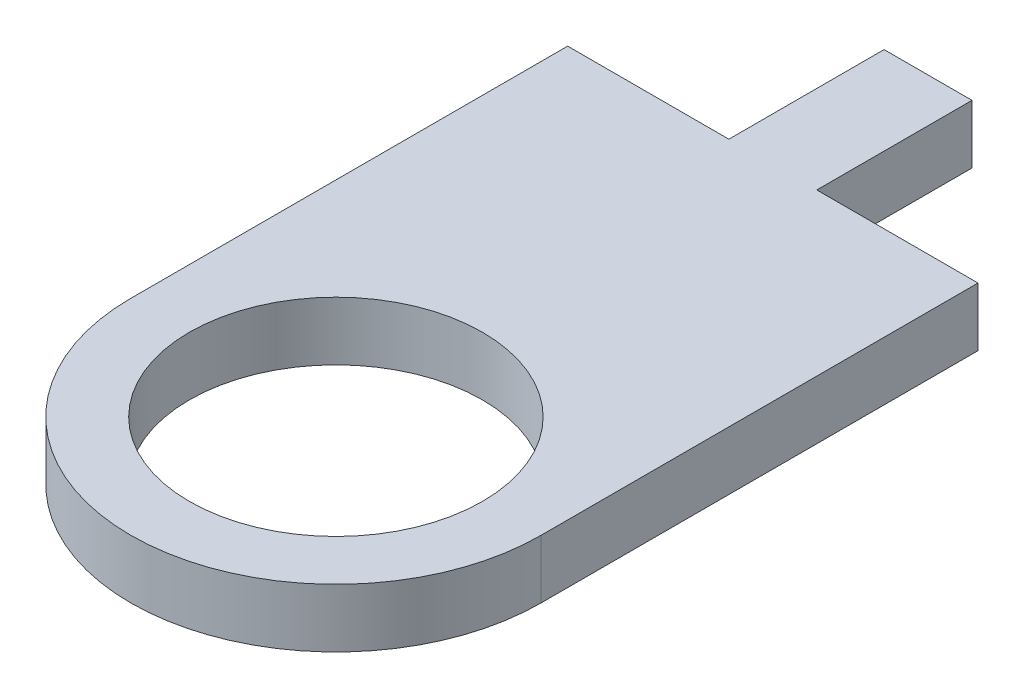
ISO-10303-21;
HEADER;
FILE_DESCRIPTION(('STEP AP214'),'2;1');
FILE_NAME('part.step','',(''),(''),'','','');
FILE_SCHEMA(('AUTOMOTIVE_DESIGN { 1 0 10303 214 1 1 1 1 }'));
ENDSEC;
DATA;
#1=APPLICATION_CONTEXT('core data for automotive mechanical design processes');
#2=APPLICATION_PROTOCOL_DEFINITION('international standard','automotive_design',2000,#1);
#3=PRODUCT_CONTEXT('',#1,'mechanical');
#4=PRODUCT('Part','Part','',(#3));
#5=PRODUCT_RELATED_PRODUCT_CATEGORY('part','',(#4));
#6=PRODUCT_DEFINITION_FORMATION('','',#4);
#7=PRODUCT_DEFINITION_CONTEXT('part definition',#1,'design');
#8=PRODUCT_DEFINITION('design','',#6,#7);
#9=PRODUCT_DEFINITION_SHAPE('','',#8);
#10=(LENGTH_UNIT() NAMED_UNIT(*) SI_UNIT(.MILLI.,.METRE.));
#11=(NAMED_UNIT(*) PLANE_ANGLE_UNIT() SI_UNIT($,.RADIAN.));
#12=(NAMED_UNIT(*) SI_UNIT($,.STERADIAN.) SOLID_ANGLE_UNIT());
#13=UNCERTAINTY_MEASURE_WITH_UNIT(LENGTH_MEASURE(1.E-05),#10,'distance_accuracy_value','');
#14=(GEOMETRIC_REPRESENTATION_CONTEXT(3) GLOBAL_UNCERTAINTY_ASSIGNED_CONTEXT((#13)) GLOBAL_UNIT_ASSIGNED_CONTEXT((#10,
#11,#12)) REPRESENTATION_CONTEXT('',''));
#15=CARTESIAN_POINT('',(0.,0.,0.));
#16=DIRECTION('',(0.,0.,1.));
#17=DIRECTION('',(1.,0.,0.));
#18=AXIS2_PLACEMENT_3D('',#15,#16,#17);
#19=CARTESIAN_POINT('',(0.,10.,0.));
#20=DIRECTION('',(0.,-1.,0.));
#21=DIRECTION('',(0.,0.,-1.));
#22=AXIS2_PLACEMENT_3D('',#19,#20,#21);
#23=CYLINDRICAL_SURFACE('',#22,35.);
#24=CARTESIAN_POINT('',(0.,0.,0.));
#25=DIRECTION('',(0.,1.,0.));
#26=DIRECTION('',(0.,0.,1.));
#27=AXIS2_PLACEMENT_3D('',#24,#25,#26);
#28=CIRCLE('',#27,35.);
#29=CARTESIAN_POINT('',(-35.,0.,0.));
#30=VERTEX_POINT('',#29);
#31=CARTESIAN_POINT('',(35.,0.,0.));
#32=VERTEX_POINT('',#31);
#33=EDGE_CURVE('E148',#30,#32,#28,.T.);
#34=ORIENTED_EDGE('',*,*,#33,.T.);
#35=DIRECTION('',(0.,-1.,0.));
#36=VECTOR('',#35,1.);
#37=CARTESIAN_POINT('',(35.,10.,0.));
#38=LINE('',#37,#36);
#39=CARTESIAN_POINT('',(35.,10.,0.));
#40=VERTEX_POINT('',#39);
#41=EDGE_CURVE('E11',#40,#32,#38,.T.);
#42=ORIENTED_EDGE('',*,*,#41,.F.);
#43=CARTESIAN_POINT('',(0.,10.,0.));
#44=DIRECTION('',(0.,1.,0.));
#45=DIRECTION('',(0.,0.,1.));
#46=AXIS2_PLACEMENT_3D('',#43,#44,#45);
#47=CIRCLE('',#46,35.);
#48=CARTESIAN_POINT('',(-35.,10.,0.));
#49=VERTEX_POINT('',#48);
#50=EDGE_CURVE('E210',#49,#40,#47,.T.);
#51=ORIENTED_EDGE('',*,*,#50,.F.);
#52=DIRECTION('',(0.,-1.,0.));
#53=VECTOR('',#52,1.);
#54=CARTESIAN_POINT('',(-35.,10.,0.));
#55=LINE('',#54,#53);
#56=EDGE_CURVE('E59',#49,#30,#55,.T.);
#57=ORIENTED_EDGE('',*,*,#56,.T.);
#58=EDGE_LOOP('',(#34,#42,#51,#57));
#59=FACE_BOUND('',#58,.T.);
#60=ADVANCED_FACE('F41',(#59),#23,.T.);
#61=CARTESIAN_POINT('',(35.,10.,0.));
#62=DIRECTION('',(-1.,0.,0.));
#63=DIRECTION('',(0.,0.,1.));
#64=AXIS2_PLACEMENT_3D('',#61,#62,#63);
#65=PLANE('',#64);
#66=DIRECTION('',(0.,0.,-1.));
#67=VECTOR('',#66,1.);
#68=CARTESIAN_POINT('',(35.,0.,0.));
#69=LINE('',#68,#67);
#70=CARTESIAN_POINT('',(35.,0.,-74.5346028699995));
#71=VERTEX_POINT('',#70);
#72=EDGE_CURVE('E151',#32,#71,#69,.T.);
#73=ORIENTED_EDGE('',*,*,#72,.T.);
#74=DIRECTION('',(0.,-1.,0.));
#75=VECTOR('',#74,1.);
#76=CARTESIAN_POINT('',(35.,10.,-74.5346028699995));
#77=LINE('',#76,#75);
#78=CARTESIAN_POINT('',(35.,10.,-74.5346028699995));
#79=VERTEX_POINT('',#78);
#80=EDGE_CURVE('E51',#79,#71,#77,.T.);
#81=ORIENTED_EDGE('',*,*,#80,.F.);
#82=DIRECTION('',(0.,0.,-1.));
#83=VECTOR('',#82,1.);
#84=CARTESIAN_POINT('',(35.,10.,0.));
#85=LINE('',#84,#83);
#86=EDGE_CURVE('E97',#40,#79,#85,.T.);
#87=ORIENTED_EDGE('',*,*,#86,.F.);
#88=ORIENTED_EDGE('',*,*,#41,.T.);
#89=EDGE_LOOP('',(#73,#81,#87,#88));
#90=FACE_BOUND('',#89,.T.);
#91=ADVANCED_FACE('F195',(#90),#65,.F.);
#92=CARTESIAN_POINT('',(0.,10.,-74.5346028699995));
#93=DIRECTION('',(0.,0.,-1.));
#94=DIRECTION('',(-1.,0.,0.));
#95=AXIS2_PLACEMENT_3D('',#92,#93,#94);
#96=PLANE('',#95);
#97=DIRECTION('',(1.,0.,0.));
#98=VECTOR('',#97,1.);
#99=CARTESIAN_POINT('',(0.,0.,-74.5346028699995));
#100=LINE('',#99,#98);
#101=CARTESIAN_POINT('',(7.5,0.,-74.5346028699995));
#102=VERTEX_POINT('',#101);
#103=EDGE_CURVE('E155',#102,#71,#100,.T.);
#104=ORIENTED_EDGE('',*,*,#103,.F.);
#105=DIRECTION('',(0.,-1.,0.));
#106=VECTOR('',#105,1.);
#107=CARTESIAN_POINT('',(7.5,10.,-74.5346028699995));
#108=LINE('',#107,#106);
#109=CARTESIAN_POINT('',(7.5,10.,-74.5346028699995));
#110=VERTEX_POINT('',#109);
#111=EDGE_CURVE('E186',#110,#102,#108,.T.);
#112=ORIENTED_EDGE('',*,*,#111,.F.);
#113=DIRECTION('',(1.,0.,0.));
#114=VECTOR('',#113,1.);
#115=CARTESIAN_POINT('',(0.,10.,-74.5346028699995));
#116=LINE('',#115,#114);
#117=EDGE_CURVE('E194',#110,#79,#116,.T.);
#118=ORIENTED_EDGE('',*,*,#117,.T.);
#119=ORIENTED_EDGE('',*,*,#80,.T.);
#120=EDGE_LOOP('',(#104,#112,#118,#119));
#121=FACE_BOUND('',#120,.T.);
#122=ADVANCED_FACE('F192',(#121),#96,.T.);
#123=CARTESIAN_POINT('',(7.5,10.,0.));
#124=DIRECTION('',(1.,0.,0.));
#125=DIRECTION('',(0.,0.,-1.));
#126=AXIS2_PLACEMENT_3D('',#123,#124,#125);
#127=PLANE('',#126);
#128=DIRECTION('',(0.,0.,1.));
#129=VECTOR('',#128,1.);
#130=CARTESIAN_POINT('',(7.5,0.,0.));
#131=LINE('',#130,#129);
#132=CARTESIAN_POINT('',(7.5,0.,-101.011615081727));
#133=VERTEX_POINT('',#132);
#134=EDGE_CURVE('E159',#133,#102,#131,.T.);
#135=ORIENTED_EDGE('',*,*,#134,.F.);
#136=DIRECTION('',(0.,-1.,0.));
#137=VECTOR('',#136,1.);
#138=CARTESIAN_POINT('',(7.5,10.,-101.011615081727));
#139=LINE('',#138,#137);
#140=CARTESIAN_POINT('',(7.5,10.,-101.011615081727));
#141=VERTEX_POINT('',#140);
#142=EDGE_CURVE('E183',#141,#133,#139,.T.);
#143=ORIENTED_EDGE('',*,*,#142,.F.);
#144=DIRECTION('',(0.,0.,1.));
#145=VECTOR('',#144,1.);
#146=CARTESIAN_POINT('',(7.5,10.,0.));
#147=LINE('',#146,#145);
#148=EDGE_CURVE('E204',#141,#110,#147,.T.);
#149=ORIENTED_EDGE('',*,*,#148,.T.);
#150=ORIENTED_EDGE('',*,*,#111,.T.);
#151=EDGE_LOOP('',(#135,#143,#149,#150));
#152=FACE_BOUND('',#151,.T.);
#153=ADVANCED_FACE('F202',(#152),#127,.T.);
#154=CARTESIAN_POINT('',(0.,10.,-101.011615081727));
#155=DIRECTION('',(0.,0.,-1.));
#156=DIRECTION('',(-1.,0.,0.));
#157=AXIS2_PLACEMENT_3D('',#154,#155,#156);
#158=PLANE('',#157);
#159=DIRECTION('',(1.,0.,0.));
#160=VECTOR('',#159,1.);
#161=CARTESIAN_POINT('',(0.,0.,-101.011615081727));
#162=LINE('',#161,#160);
#163=CARTESIAN_POINT('',(-7.5,0.,-101.011615081727));
#164=VERTEX_POINT('',#163);
#165=EDGE_CURVE('E163',#164,#133,#162,.T.);
#166=ORIENTED_EDGE('',*,*,#165,.F.);
#167=DIRECTION('',(0.,-1.,0.));
#168=VECTOR('',#167,1.);
#169=CARTESIAN_POINT('',(-7.5,10.,-101.011615081727));
#170=LINE('',#169,#168);
#171=CARTESIAN_POINT('',(-7.5,10.,-101.011615081727));
#172=VERTEX_POINT('',#171);
#173=EDGE_CURVE('E123',#172,#164,#170,.T.);
#174=ORIENTED_EDGE('',*,*,#173,.F.);
#175=DIRECTION('',(1.,0.,0.));
#176=VECTOR('',#175,1.);
#177=CARTESIAN_POINT('',(0.,10.,-101.011615081727));
#178=LINE('',#177,#176);
#179=EDGE_CURVE('E133',#172,#141,#178,.T.);
#180=ORIENTED_EDGE('',*,*,#179,.T.);
#181=ORIENTED_EDGE('',*,*,#142,.T.);
#182=EDGE_LOOP('',(#166,#174,#180,#181));
#183=FACE_BOUND('',#182,.T.);
#184=ADVANCED_FACE('F215',(#183),#158,.T.);
#185=CARTESIAN_POINT('',(-7.5,10.,0.));
#186=DIRECTION('',(-1.,0.,0.));
#187=DIRECTION('',(0.,0.,1.));
#188=AXIS2_PLACEMENT_3D('',#185,#186,#187);
#189=PLANE('',#188);
#190=DIRECTION('',(0.,0.,-1.));
#191=VECTOR('',#190,1.);
#192=CARTESIAN_POINT('',(-7.5,0.,0.));
#193=LINE('',#192,#191);
#194=CARTESIAN_POINT('',(-7.5,0.,-74.5346028699995));
#195=VERTEX_POINT('',#194);
#196=EDGE_CURVE('E118',#195,#164,#193,.T.);
#197=ORIENTED_EDGE('',*,*,#196,.F.);
#198=DIRECTION('',(0.,-1.,0.));
#199=VECTOR('',#198,1.);
#200=CARTESIAN_POINT('',(-7.5,10.,-74.5346028699995));
#201=LINE('',#200,#199);
#202=CARTESIAN_POINT('',(-7.5,10.,-74.5346028699995));
#203=VERTEX_POINT('',#202);
#204=EDGE_CURVE('E113',#203,#195,#201,.T.);
#205=ORIENTED_EDGE('',*,*,#204,.F.);
#206=DIRECTION('',(0.,0.,-1.));
#207=VECTOR('',#206,1.);
#208=CARTESIAN_POINT('',(-7.5,10.,0.));
#209=LINE('',#208,#207);
#210=EDGE_CURVE('E116',#203,#172,#209,.T.);
#211=ORIENTED_EDGE('',*,*,#210,.T.);
#212=ORIENTED_EDGE('',*,*,#173,.T.);
#213=EDGE_LOOP('',(#197,#205,#211,#212));
#214=FACE_BOUND('',#213,.T.);
#215=ADVANCED_FACE('F115',(#214),#189,.T.);
#216=CARTESIAN_POINT('',(0.,10.,-74.5346028699995));
#217=DIRECTION('',(0.,0.,-1.));
#218=DIRECTION('',(-1.,0.,0.));
#219=AXIS2_PLACEMENT_3D('',#216,#217,#218);
#220=PLANE('',#219);
#221=DIRECTION('',(1.,0.,0.));
#222=VECTOR('',#221,1.);
#223=CARTESIAN_POINT('',(0.,0.,-74.5346028699995));
#224=LINE('',#223,#222);
#225=CARTESIAN_POINT('',(-35.,0.,-74.5346028699995));
#226=VERTEX_POINT('',#225);
#227=EDGE_CURVE('E169',#226,#195,#224,.T.);
#228=ORIENTED_EDGE('',*,*,#227,.F.);
#229=DIRECTION('',(0.,-1.,0.));
#230=VECTOR('',#229,1.);
#231=CARTESIAN_POINT('',(-35.,10.,-74.5346028699995));
#232=LINE('',#231,#230);
#233=CARTESIAN_POINT('',(-35.,10.,-74.5346028699995));
#234=VERTEX_POINT('',#233);
#235=EDGE_CURVE('E85',#234,#226,#232,.T.);
#236=ORIENTED_EDGE('',*,*,#235,.F.);
#237=DIRECTION('',(1.,0.,0.));
#238=VECTOR('',#237,1.);
#239=CARTESIAN_POINT('',(0.,10.,-74.5346028699995));
#240=LINE('',#239,#238);
#241=EDGE_CURVE('E130',#234,#203,#240,.T.);
#242=ORIENTED_EDGE('',*,*,#241,.T.);
#243=ORIENTED_EDGE('',*,*,#204,.T.);
#244=EDGE_LOOP('',(#228,#236,#242,#243));
#245=FACE_BOUND('',#244,.T.);
#246=ADVANCED_FACE('F136',(#245),#220,.T.);
#247=CARTESIAN_POINT('',(0.,10.,0.));
#248=DIRECTION('',(0.,-1.,0.));
#249=DIRECTION('',(0.,0.,-1.));
#250=AXIS2_PLACEMENT_3D('',#247,#248,#249);
#251=CYLINDRICAL_SURFACE('',#250,25.);
#252=CARTESIAN_POINT('',(0.,10.,0.));
#253=DIRECTION('',(0.,1.,0.));
#254=DIRECTION('',(0.,0.,1.));
#255=AXIS2_PLACEMENT_3D('',#252,#253,#254);
#256=CIRCLE('',#255,25.);
#257=CARTESIAN_POINT('',(0.,10.,25.));
#258=VERTEX_POINT('',#257);
#259=EDGE_CURVE('E176',#258,#258,#256,.T.);
#260=ORIENTED_EDGE('',*,*,#259,.T.);
#261=EDGE_LOOP('',(#260));
#262=FACE_BOUND('',#261,.T.);
#263=CARTESIAN_POINT('',(0.,0.,0.));
#264=DIRECTION('',(0.,1.,0.));
#265=DIRECTION('',(0.,0.,1.));
#266=AXIS2_PLACEMENT_3D('',#263,#264,#265);
#267=CIRCLE('',#266,25.);
#268=CARTESIAN_POINT('',(0.,0.,25.));
#269=VERTEX_POINT('',#268);
#270=EDGE_CURVE('E144',#269,#269,#267,.T.);
#271=ORIENTED_EDGE('',*,*,#270,.F.);
#272=EDGE_LOOP('',(#271));
#273=FACE_BOUND('',#272,.T.);
#274=ADVANCED_FACE('F43',(#262,#273),#251,.F.);
#275=CARTESIAN_POINT('',(-35.,10.,0.));
#276=DIRECTION('',(-1.,0.,0.));
#277=DIRECTION('',(0.,0.,1.));
#278=AXIS2_PLACEMENT_3D('',#275,#276,#277);
#279=PLANE('',#278);
#280=DIRECTION('',(0.,0.,-1.));
#281=VECTOR('',#280,1.);
#282=CARTESIAN_POINT('',(-35.,0.,0.));
#283=LINE('',#282,#281);
#284=EDGE_CURVE('E172',#30,#226,#283,.T.);
#285=ORIENTED_EDGE('',*,*,#284,.F.);
#286=ORIENTED_EDGE('',*,*,#56,.F.);
#287=DIRECTION('',(0.,0.,-1.));
#288=VECTOR('',#287,1.);
#289=CARTESIAN_POINT('',(-35.,10.,0.));
#290=LINE('',#289,#288);
#291=EDGE_CURVE('E138',#49,#234,#290,.T.);
#292=ORIENTED_EDGE('',*,*,#291,.T.);
#293=ORIENTED_EDGE('',*,*,#235,.T.);
#294=EDGE_LOOP('',(#285,#286,#292,#293));
#295=FACE_BOUND('',#294,.T.);
#296=ADVANCED_FACE('F216',(#295),#279,.T.);
#297=CARTESIAN_POINT('',(0.,10.,0.));
#298=DIRECTION('',(0.,1.,0.));
#299=DIRECTION('',(0.,0.,1.));
#300=AXIS2_PLACEMENT_3D('',#297,#298,#299);
#301=PLANE('',#300);
#302=ORIENTED_EDGE('',*,*,#259,.F.);
#303=EDGE_LOOP('',(#302));
#304=FACE_BOUND('',#303,.T.);
#305=ORIENTED_EDGE('',*,*,#50,.T.);
#306=ORIENTED_EDGE('',*,*,#86,.T.);
#307=ORIENTED_EDGE('',*,*,#117,.F.);
#308=ORIENTED_EDGE('',*,*,#148,.F.);
#309=ORIENTED_EDGE('',*,*,#179,.F.);
#310=ORIENTED_EDGE('',*,*,#210,.F.);
#311=ORIENTED_EDGE('',*,*,#241,.F.);
#312=ORIENTED_EDGE('',*,*,#291,.F.);
#313=EDGE_LOOP('',(#305,#306,#307,#308,#309,#310,#311,#312));
#314=FACE_BOUND('',#313,.T.);
#315=ADVANCED_FACE('F128',(#304,#314),#301,.T.);
#316=CARTESIAN_POINT('',(0.,0.,0.));
#317=DIRECTION('',(0.,1.,0.));
#318=DIRECTION('',(0.,0.,1.));
#319=AXIS2_PLACEMENT_3D('',#316,#317,#318);
#320=PLANE('',#319);
#321=ORIENTED_EDGE('',*,*,#270,.T.);
#322=EDGE_LOOP('',(#321));
#323=FACE_BOUND('',#322,.T.);
#324=ORIENTED_EDGE('',*,*,#33,.F.);
#325=ORIENTED_EDGE('',*,*,#284,.T.);
#326=ORIENTED_EDGE('',*,*,#227,.T.);
#327=ORIENTED_EDGE('',*,*,#196,.T.);
#328=ORIENTED_EDGE('',*,*,#165,.T.);
#329=ORIENTED_EDGE('',*,*,#134,.T.);
#330=ORIENTED_EDGE('',*,*,#103,.T.);
#331=ORIENTED_EDGE('',*,*,#72,.F.);
#332=EDGE_LOOP('',(#324,#325,#326,#327,#328,#329,#330,#331));
#333=FACE_BOUND('',#332,.T.);
#334=ADVANCED_FACE('F198',(#323,#333),#320,.F.);
#335=CLOSED_SHELL('',(#60,#91,#122,#153,#184,#215,#246,#274,#296,#315,#334));
#336=MANIFOLD_SOLID_BREP('B2',#335);
#337=ADVANCED_BREP_SHAPE_REPRESENTATION('',(#18,#336),#14);
#338=SHAPE_DEFINITION_REPRESENTATION(#9,#337);
ENDSEC;
END-ISO-10303-21;
